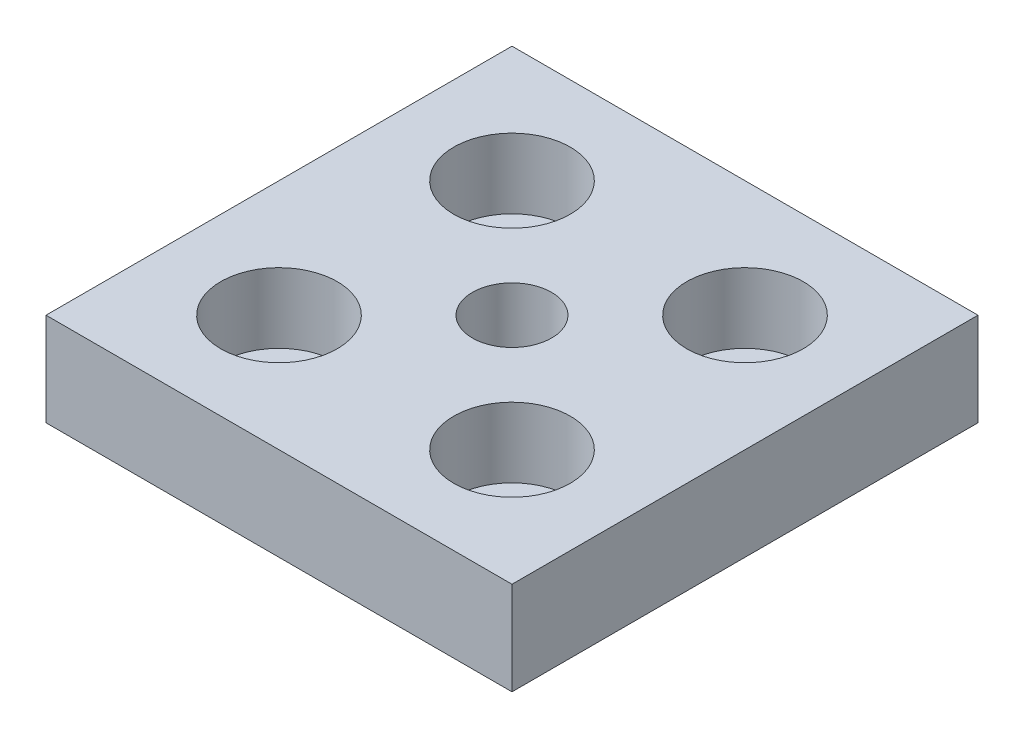
ISO-10303-21;
HEADER;
FILE_DESCRIPTION(('STEP AP214'),'2;1');
FILE_NAME('part.step','',(''),(''),'','','');
FILE_SCHEMA(('AUTOMOTIVE_DESIGN { 1 0 10303 214 1 1 1 1 }'));
ENDSEC;
DATA;
#1=APPLICATION_CONTEXT('core data for automotive mechanical design processes');
#2=APPLICATION_PROTOCOL_DEFINITION('international standard','automotive_design',2000,#1);
#3=PRODUCT_CONTEXT('',#1,'mechanical');
#4=PRODUCT('Part','Part','',(#3));
#5=PRODUCT_RELATED_PRODUCT_CATEGORY('part','',(#4));
#6=PRODUCT_DEFINITION_FORMATION('','',#4);
#7=PRODUCT_DEFINITION_CONTEXT('part definition',#1,'design');
#8=PRODUCT_DEFINITION('design','',#6,#7);
#9=PRODUCT_DEFINITION_SHAPE('','',#8);
#10=(LENGTH_UNIT() NAMED_UNIT(*) SI_UNIT(.MILLI.,.METRE.));
#11=(NAMED_UNIT(*) PLANE_ANGLE_UNIT() SI_UNIT($,.RADIAN.));
#12=(NAMED_UNIT(*) SI_UNIT($,.STERADIAN.) SOLID_ANGLE_UNIT());
#13=UNCERTAINTY_MEASURE_WITH_UNIT(LENGTH_MEASURE(1.E-05),#10,'distance_accuracy_value','');
#14=(GEOMETRIC_REPRESENTATION_CONTEXT(3) GLOBAL_UNCERTAINTY_ASSIGNED_CONTEXT((#13)) GLOBAL_UNIT_ASSIGNED_CONTEXT((#10,
#11,#12)) REPRESENTATION_CONTEXT('',''));
#15=CARTESIAN_POINT('',(0.,0.,0.));
#16=DIRECTION('',(0.,0.,1.));
#17=DIRECTION('',(1.,0.,0.));
#18=AXIS2_PLACEMENT_3D('',#15,#16,#17);
#19=CARTESIAN_POINT('',(-15.,0.,-15.));
#20=DIRECTION('',(0.,1.,0.));
#21=DIRECTION('',(0.,0.,1.));
#22=AXIS2_PLACEMENT_3D('',#19,#20,#21);
#23=CYLINDRICAL_SURFACE('',#22,4.5);
#24=CARTESIAN_POINT('',(-15.,0.,-15.));
#25=DIRECTION('',(0.,1.,0.));
#26=DIRECTION('',(0.,0.,1.));
#27=AXIS2_PLACEMENT_3D('',#24,#25,#26);
#28=CIRCLE('',#27,4.5);
#29=CARTESIAN_POINT('',(-15.,0.,-10.5));
#30=VERTEX_POINT('',#29);
#31=EDGE_CURVE('E137',#30,#30,#28,.T.);
#32=ORIENTED_EDGE('',*,*,#31,.F.);
#33=EDGE_LOOP('',(#32));
#34=FACE_BOUND('',#33,.T.);
#35=CARTESIAN_POINT('',(-15.,3.,-15.));
#36=DIRECTION('',(0.,1.,0.));
#37=DIRECTION('',(0.,0.,1.));
#38=AXIS2_PLACEMENT_3D('',#35,#36,#37);
#39=CIRCLE('',#38,4.5);
#40=CARTESIAN_POINT('',(-15.,3.,-10.5));
#41=VERTEX_POINT('',#40);
#42=EDGE_CURVE('E41',#41,#41,#39,.F.);
#43=ORIENTED_EDGE('',*,*,#42,.F.);
#44=EDGE_LOOP('',(#43));
#45=FACE_BOUND('',#44,.T.);
#46=ADVANCED_FACE('F37',(#34,#45),#23,.F.);
#47=CARTESIAN_POINT('',(15.,0.,-15.));
#48=DIRECTION('',(0.,1.,0.));
#49=DIRECTION('',(0.,0.,1.));
#50=AXIS2_PLACEMENT_3D('',#47,#48,#49);
#51=CYLINDRICAL_SURFACE('',#50,4.5);
#52=CARTESIAN_POINT('',(15.,0.,-15.));
#53=DIRECTION('',(0.,1.,0.));
#54=DIRECTION('',(0.,0.,1.));
#55=AXIS2_PLACEMENT_3D('',#52,#53,#54);
#56=CIRCLE('',#55,4.5);
#57=CARTESIAN_POINT('',(15.,0.,-10.5));
#58=VERTEX_POINT('',#57);
#59=EDGE_CURVE('E133',#58,#58,#56,.T.);
#60=ORIENTED_EDGE('',*,*,#59,.F.);
#61=EDGE_LOOP('',(#60));
#62=FACE_BOUND('',#61,.T.);
#63=CARTESIAN_POINT('',(15.,3.,-15.));
#64=DIRECTION('',(0.,1.,0.));
#65=DIRECTION('',(0.,0.,1.));
#66=AXIS2_PLACEMENT_3D('',#63,#64,#65);
#67=CIRCLE('',#66,4.5);
#68=CARTESIAN_POINT('',(15.,3.,-10.5));
#69=VERTEX_POINT('',#68);
#70=EDGE_CURVE('E119',#69,#69,#67,.F.);
#71=ORIENTED_EDGE('',*,*,#70,.F.);
#72=EDGE_LOOP('',(#71));
#73=FACE_BOUND('',#72,.T.);
#74=ADVANCED_FACE('F165',(#62,#73),#51,.F.);
#75=CARTESIAN_POINT('',(15.,0.,15.));
#76=DIRECTION('',(0.,1.,0.));
#77=DIRECTION('',(0.,0.,1.));
#78=AXIS2_PLACEMENT_3D('',#75,#76,#77);
#79=CYLINDRICAL_SURFACE('',#78,4.5);
#80=CARTESIAN_POINT('',(15.,0.,15.));
#81=DIRECTION('',(0.,1.,0.));
#82=DIRECTION('',(0.,0.,1.));
#83=AXIS2_PLACEMENT_3D('',#80,#81,#82);
#84=CIRCLE('',#83,4.5);
#85=CARTESIAN_POINT('',(15.,0.,19.5));
#86=VERTEX_POINT('',#85);
#87=EDGE_CURVE('E128',#86,#86,#84,.T.);
#88=ORIENTED_EDGE('',*,*,#87,.F.);
#89=EDGE_LOOP('',(#88));
#90=FACE_BOUND('',#89,.T.);
#91=CARTESIAN_POINT('',(15.,3.,15.));
#92=DIRECTION('',(0.,1.,0.));
#93=DIRECTION('',(0.,0.,1.));
#94=AXIS2_PLACEMENT_3D('',#91,#92,#93);
#95=CIRCLE('',#94,4.5);
#96=CARTESIAN_POINT('',(15.,3.,19.5));
#97=VERTEX_POINT('',#96);
#98=EDGE_CURVE('E116',#97,#97,#95,.F.);
#99=ORIENTED_EDGE('',*,*,#98,.F.);
#100=EDGE_LOOP('',(#99));
#101=FACE_BOUND('',#100,.T.);
#102=ADVANCED_FACE('F171',(#90,#101),#79,.F.);
#103=CARTESIAN_POINT('',(-15.,0.,15.));
#104=DIRECTION('',(0.,1.,0.));
#105=DIRECTION('',(0.,0.,1.));
#106=AXIS2_PLACEMENT_3D('',#103,#104,#105);
#107=CYLINDRICAL_SURFACE('',#106,4.5);
#108=CARTESIAN_POINT('',(-15.,0.,15.));
#109=DIRECTION('',(0.,1.,0.));
#110=DIRECTION('',(0.,0.,1.));
#111=AXIS2_PLACEMENT_3D('',#108,#109,#110);
#112=CIRCLE('',#111,4.5);
#113=CARTESIAN_POINT('',(-15.,0.,19.5));
#114=VERTEX_POINT('',#113);
#115=EDGE_CURVE('E124',#114,#114,#112,.T.);
#116=ORIENTED_EDGE('',*,*,#115,.F.);
#117=EDGE_LOOP('',(#116));
#118=FACE_BOUND('',#117,.T.);
#119=CARTESIAN_POINT('',(-15.,3.,15.));
#120=DIRECTION('',(0.,1.,0.));
#121=DIRECTION('',(0.,0.,1.));
#122=AXIS2_PLACEMENT_3D('',#119,#120,#121);
#123=CIRCLE('',#122,4.5);
#124=CARTESIAN_POINT('',(-15.,3.,19.5));
#125=VERTEX_POINT('',#124);
#126=EDGE_CURVE('E113',#125,#125,#123,.F.);
#127=ORIENTED_EDGE('',*,*,#126,.F.);
#128=EDGE_LOOP('',(#127));
#129=FACE_BOUND('',#128,.T.);
#130=ADVANCED_FACE('F178',(#118,#129),#107,.F.);
#131=CARTESIAN_POINT('',(30.,12.,30.));
#132=DIRECTION('',(-1.,0.,0.));
#133=DIRECTION('',(0.,0.,1.));
#134=AXIS2_PLACEMENT_3D('',#131,#132,#133);
#135=PLANE('',#134);
#136=DIRECTION('',(0.,0.,-1.));
#137=VECTOR('',#136,1.);
#138=CARTESIAN_POINT('',(30.,0.,30.));
#139=LINE('',#138,#137);
#140=CARTESIAN_POINT('',(30.,0.,30.));
#141=VERTEX_POINT('',#140);
#142=CARTESIAN_POINT('',(30.,0.,-30.));
#143=VERTEX_POINT('',#142);
#144=EDGE_CURVE('E104',#141,#143,#139,.T.);
#145=ORIENTED_EDGE('',*,*,#144,.T.);
#146=DIRECTION('',(0.,-1.,0.));
#147=VECTOR('',#146,1.);
#148=CARTESIAN_POINT('',(30.,12.,-30.));
#149=LINE('',#148,#147);
#150=CARTESIAN_POINT('',(30.,12.,-30.));
#151=VERTEX_POINT('',#150);
#152=EDGE_CURVE('E11',#151,#143,#149,.T.);
#153=ORIENTED_EDGE('',*,*,#152,.F.);
#154=DIRECTION('',(0.,0.,-1.));
#155=VECTOR('',#154,1.);
#156=CARTESIAN_POINT('',(30.,12.,30.));
#157=LINE('',#156,#155);
#158=CARTESIAN_POINT('',(30.,12.,30.));
#159=VERTEX_POINT('',#158);
#160=EDGE_CURVE('E91',#159,#151,#157,.T.);
#161=ORIENTED_EDGE('',*,*,#160,.F.);
#162=DIRECTION('',(0.,-1.,0.));
#163=VECTOR('',#162,1.);
#164=CARTESIAN_POINT('',(30.,12.,30.));
#165=LINE('',#164,#163);
#166=EDGE_CURVE('E100',#159,#141,#165,.T.);
#167=ORIENTED_EDGE('',*,*,#166,.T.);
#168=EDGE_LOOP('',(#145,#153,#161,#167));
#169=FACE_BOUND('',#168,.T.);
#170=ADVANCED_FACE('F39',(#169),#135,.F.);
#171=CARTESIAN_POINT('',(-30.,12.,-30.));
#172=DIRECTION('',(0.,0.,1.));
#173=DIRECTION('',(1.,0.,0.));
#174=AXIS2_PLACEMENT_3D('',#171,#172,#173);
#175=PLANE('',#174);
#176=DIRECTION('',(-1.,0.,0.));
#177=VECTOR('',#176,1.);
#178=CARTESIAN_POINT('',(-30.,0.,-30.));
#179=LINE('',#178,#177);
#180=CARTESIAN_POINT('',(-30.,0.,-30.));
#181=VERTEX_POINT('',#180);
#182=EDGE_CURVE('E95',#143,#181,#179,.T.);
#183=ORIENTED_EDGE('',*,*,#182,.T.);
#184=DIRECTION('',(0.,-1.,0.));
#185=VECTOR('',#184,1.);
#186=CARTESIAN_POINT('',(-30.,12.,-30.));
#187=LINE('',#186,#185);
#188=CARTESIAN_POINT('',(-30.,12.,-30.));
#189=VERTEX_POINT('',#188);
#190=EDGE_CURVE('E47',#189,#181,#187,.T.);
#191=ORIENTED_EDGE('',*,*,#190,.F.);
#192=DIRECTION('',(-1.,0.,0.));
#193=VECTOR('',#192,1.);
#194=CARTESIAN_POINT('',(-30.,12.,-30.));
#195=LINE('',#194,#193);
#196=EDGE_CURVE('E86',#151,#189,#195,.T.);
#197=ORIENTED_EDGE('',*,*,#196,.F.);
#198=ORIENTED_EDGE('',*,*,#152,.T.);
#199=EDGE_LOOP('',(#183,#191,#197,#198));
#200=FACE_BOUND('',#199,.T.);
#201=ADVANCED_FACE('F94',(#200),#175,.F.);
#202=CARTESIAN_POINT('',(-30.,12.,30.));
#203=DIRECTION('',(1.,0.,0.));
#204=DIRECTION('',(0.,0.,-1.));
#205=AXIS2_PLACEMENT_3D('',#202,#203,#204);
#206=PLANE('',#205);
#207=DIRECTION('',(0.,0.,1.));
#208=VECTOR('',#207,1.);
#209=CARTESIAN_POINT('',(-30.,0.,30.));
#210=LINE('',#209,#208);
#211=CARTESIAN_POINT('',(-30.,0.,30.));
#212=VERTEX_POINT('',#211);
#213=EDGE_CURVE('E73',#181,#212,#210,.T.);
#214=ORIENTED_EDGE('',*,*,#213,.T.);
#215=DIRECTION('',(0.,-1.,0.));
#216=VECTOR('',#215,1.);
#217=CARTESIAN_POINT('',(-30.,12.,30.));
#218=LINE('',#217,#216);
#219=CARTESIAN_POINT('',(-30.,12.,30.));
#220=VERTEX_POINT('',#219);
#221=EDGE_CURVE('E96',#220,#212,#218,.T.);
#222=ORIENTED_EDGE('',*,*,#221,.F.);
#223=DIRECTION('',(0.,0.,1.));
#224=VECTOR('',#223,1.);
#225=CARTESIAN_POINT('',(-30.,12.,30.));
#226=LINE('',#225,#224);
#227=EDGE_CURVE('E89',#189,#220,#226,.T.);
#228=ORIENTED_EDGE('',*,*,#227,.F.);
#229=ORIENTED_EDGE('',*,*,#190,.T.);
#230=EDGE_LOOP('',(#214,#222,#228,#229));
#231=FACE_BOUND('',#230,.T.);
#232=ADVANCED_FACE('F98',(#231),#206,.F.);
#233=CARTESIAN_POINT('',(-30.,12.,30.));
#234=DIRECTION('',(0.,0.,-1.));
#235=DIRECTION('',(-1.,0.,0.));
#236=AXIS2_PLACEMENT_3D('',#233,#234,#235);
#237=PLANE('',#236);
#238=DIRECTION('',(1.,0.,0.));
#239=VECTOR('',#238,1.);
#240=CARTESIAN_POINT('',(-30.,0.,30.));
#241=LINE('',#240,#239);
#242=EDGE_CURVE('E79',#212,#141,#241,.T.);
#243=ORIENTED_EDGE('',*,*,#242,.T.);
#244=ORIENTED_EDGE('',*,*,#166,.F.);
#245=DIRECTION('',(1.,0.,0.));
#246=VECTOR('',#245,1.);
#247=CARTESIAN_POINT('',(-30.,12.,30.));
#248=LINE('',#247,#246);
#249=EDGE_CURVE('E56',#220,#159,#248,.T.);
#250=ORIENTED_EDGE('',*,*,#249,.F.);
#251=ORIENTED_EDGE('',*,*,#221,.T.);
#252=EDGE_LOOP('',(#243,#244,#250,#251));
#253=FACE_BOUND('',#252,.T.);
#254=ADVANCED_FACE('F154',(#253),#237,.F.);
#255=CARTESIAN_POINT('',(0.,12.,0.));
#256=DIRECTION('',(0.,-1.,0.));
#257=DIRECTION('',(0.,0.,-1.));
#258=AXIS2_PLACEMENT_3D('',#255,#256,#257);
#259=PLANE('',#258);
#260=CARTESIAN_POINT('',(-15.,12.,15.));
#261=DIRECTION('',(0.,1.,0.));
#262=DIRECTION('',(0.,0.,1.));
#263=AXIS2_PLACEMENT_3D('',#260,#261,#262);
#264=CIRCLE('',#263,7.5);
#265=CARTESIAN_POINT('',(-15.,12.,22.5));
#266=VERTEX_POINT('',#265);
#267=EDGE_CURVE('E255',#266,#266,#264,.T.);
#268=ORIENTED_EDGE('',*,*,#267,.F.);
#269=EDGE_LOOP('',(#268));
#270=FACE_BOUND('',#269,.T.);
#271=CARTESIAN_POINT('',(15.,12.,15.));
#272=DIRECTION('',(0.,1.,0.));
#273=DIRECTION('',(0.,0.,1.));
#274=AXIS2_PLACEMENT_3D('',#271,#272,#273);
#275=CIRCLE('',#274,7.5);
#276=CARTESIAN_POINT('',(15.,12.,22.5));
#277=VERTEX_POINT('',#276);
#278=EDGE_CURVE('E250',#277,#277,#275,.T.);
#279=ORIENTED_EDGE('',*,*,#278,.F.);
#280=EDGE_LOOP('',(#279));
#281=FACE_BOUND('',#280,.T.);
#282=CARTESIAN_POINT('',(15.,12.,-15.));
#283=DIRECTION('',(0.,1.,0.));
#284=DIRECTION('',(0.,0.,1.));
#285=AXIS2_PLACEMENT_3D('',#282,#283,#284);
#286=CIRCLE('',#285,7.5);
#287=CARTESIAN_POINT('',(15.,12.,-7.5));
#288=VERTEX_POINT('',#287);
#289=EDGE_CURVE('E241',#288,#288,#286,.T.);
#290=ORIENTED_EDGE('',*,*,#289,.F.);
#291=EDGE_LOOP('',(#290));
#292=FACE_BOUND('',#291,.T.);
#293=CARTESIAN_POINT('',(-15.,12.,-15.));
#294=DIRECTION('',(0.,1.,0.));
#295=DIRECTION('',(0.,0.,1.));
#296=AXIS2_PLACEMENT_3D('',#293,#294,#295);
#297=CIRCLE('',#296,7.5);
#298=CARTESIAN_POINT('',(-15.,12.,-7.5));
#299=VERTEX_POINT('',#298);
#300=EDGE_CURVE('E240',#299,#299,#297,.T.);
#301=ORIENTED_EDGE('',*,*,#300,.F.);
#302=EDGE_LOOP('',(#301));
#303=FACE_BOUND('',#302,.T.);
#304=CARTESIAN_POINT('',(0.,12.,0.));
#305=DIRECTION('',(0.,1.,0.));
#306=DIRECTION('',(0.,0.,1.));
#307=AXIS2_PLACEMENT_3D('',#304,#305,#306);
#308=CIRCLE('',#307,5.1);
#309=CARTESIAN_POINT('',(0.,12.,5.1));
#310=VERTEX_POINT('',#309);
#311=EDGE_CURVE('E140',#310,#310,#308,.T.);
#312=ORIENTED_EDGE('',*,*,#311,.F.);
#313=EDGE_LOOP('',(#312));
#314=FACE_BOUND('',#313,.T.);
#315=ORIENTED_EDGE('',*,*,#160,.T.);
#316=ORIENTED_EDGE('',*,*,#196,.T.);
#317=ORIENTED_EDGE('',*,*,#227,.T.);
#318=ORIENTED_EDGE('',*,*,#249,.T.);
#319=EDGE_LOOP('',(#315,#316,#317,#318));
#320=FACE_BOUND('',#319,.T.);
#321=ADVANCED_FACE('F87',(#270,#281,#292,#303,#314,#320),#259,.F.);
#322=CARTESIAN_POINT('',(0.,0.,0.));
#323=DIRECTION('',(0.,-1.,0.));
#324=DIRECTION('',(0.,0.,-1.));
#325=AXIS2_PLACEMENT_3D('',#322,#323,#324);
#326=PLANE('',#325);
#327=ORIENTED_EDGE('',*,*,#115,.T.);
#328=EDGE_LOOP('',(#327));
#329=FACE_BOUND('',#328,.T.);
#330=ORIENTED_EDGE('',*,*,#87,.T.);
#331=EDGE_LOOP('',(#330));
#332=FACE_BOUND('',#331,.T.);
#333=ORIENTED_EDGE('',*,*,#59,.T.);
#334=EDGE_LOOP('',(#333));
#335=FACE_BOUND('',#334,.T.);
#336=ORIENTED_EDGE('',*,*,#31,.T.);
#337=EDGE_LOOP('',(#336));
#338=FACE_BOUND('',#337,.T.);
#339=CARTESIAN_POINT('',(0.,0.,0.));
#340=DIRECTION('',(0.,-1.,0.));
#341=DIRECTION('',(0.,0.,-1.));
#342=AXIS2_PLACEMENT_3D('',#339,#340,#341);
#343=CIRCLE('',#342,5.1);
#344=CARTESIAN_POINT('',(0.,0.,-5.1));
#345=VERTEX_POINT('',#344);
#346=EDGE_CURVE('E107',#345,#345,#343,.T.);
#347=ORIENTED_EDGE('',*,*,#346,.F.);
#348=EDGE_LOOP('',(#347));
#349=FACE_BOUND('',#348,.T.);
#350=ORIENTED_EDGE('',*,*,#144,.F.);
#351=ORIENTED_EDGE('',*,*,#242,.F.);
#352=ORIENTED_EDGE('',*,*,#213,.F.);
#353=ORIENTED_EDGE('',*,*,#182,.F.);
#354=EDGE_LOOP('',(#350,#351,#352,#353));
#355=FACE_BOUND('',#354,.T.);
#356=ADVANCED_FACE('F148',(#329,#332,#335,#338,#349,#355),#326,.T.);
#357=CARTESIAN_POINT('',(0.,12.,0.));
#358=DIRECTION('',(0.,1.,0.));
#359=DIRECTION('',(0.,0.,1.));
#360=AXIS2_PLACEMENT_3D('',#357,#358,#359);
#361=CYLINDRICAL_SURFACE('',#360,5.1);
#362=ORIENTED_EDGE('',*,*,#311,.T.);
#363=EDGE_LOOP('',(#362));
#364=FACE_BOUND('',#363,.T.);
#365=ORIENTED_EDGE('',*,*,#346,.T.);
#366=EDGE_LOOP('',(#365));
#367=FACE_BOUND('',#366,.T.);
#368=ADVANCED_FACE('F146',(#364,#367),#361,.F.);
#369=CARTESIAN_POINT('',(-15.,3.,15.));
#370=DIRECTION('',(0.,1.,0.));
#371=DIRECTION('',(0.,0.,1.));
#372=AXIS2_PLACEMENT_3D('',#369,#370,#371);
#373=PLANE('',#372);
#374=CARTESIAN_POINT('',(-15.,3.,15.));
#375=DIRECTION('',(0.,1.,0.));
#376=DIRECTION('',(0.,0.,1.));
#377=AXIS2_PLACEMENT_3D('',#374,#375,#376);
#378=CIRCLE('',#377,7.5);
#379=CARTESIAN_POINT('',(-15.,3.,22.5));
#380=VERTEX_POINT('',#379);
#381=EDGE_CURVE('E253',#380,#380,#378,.T.);
#382=ORIENTED_EDGE('',*,*,#381,.T.);
#383=EDGE_LOOP('',(#382));
#384=FACE_BOUND('',#383,.T.);
#385=ORIENTED_EDGE('',*,*,#126,.T.);
#386=EDGE_LOOP('',(#385));
#387=FACE_BOUND('',#386,.T.);
#388=ADVANCED_FACE('F181',(#384,#387),#373,.T.);
#389=CARTESIAN_POINT('',(-15.,3.,15.));
#390=DIRECTION('',(0.,1.,0.));
#391=DIRECTION('',(0.,0.,1.));
#392=AXIS2_PLACEMENT_3D('',#389,#390,#391);
#393=CYLINDRICAL_SURFACE('',#392,7.5);
#394=ORIENTED_EDGE('',*,*,#381,.F.);
#395=EDGE_LOOP('',(#394));
#396=FACE_BOUND('',#395,.T.);
#397=ORIENTED_EDGE('',*,*,#267,.T.);
#398=EDGE_LOOP('',(#397));
#399=FACE_BOUND('',#398,.T.);
#400=ADVANCED_FACE('F186',(#396,#399),#393,.F.);
#401=CARTESIAN_POINT('',(15.,3.,15.));
#402=DIRECTION('',(0.,1.,0.));
#403=DIRECTION('',(0.,0.,1.));
#404=AXIS2_PLACEMENT_3D('',#401,#402,#403);
#405=PLANE('',#404);
#406=CARTESIAN_POINT('',(15.,3.,15.));
#407=DIRECTION('',(0.,1.,0.));
#408=DIRECTION('',(0.,0.,1.));
#409=AXIS2_PLACEMENT_3D('',#406,#407,#408);
#410=CIRCLE('',#409,7.5);
#411=CARTESIAN_POINT('',(15.,3.,22.5));
#412=VERTEX_POINT('',#411);
#413=EDGE_CURVE('E246',#412,#412,#410,.T.);
#414=ORIENTED_EDGE('',*,*,#413,.T.);
#415=EDGE_LOOP('',(#414));
#416=FACE_BOUND('',#415,.T.);
#417=ORIENTED_EDGE('',*,*,#98,.T.);
#418=EDGE_LOOP('',(#417));
#419=FACE_BOUND('',#418,.T.);
#420=ADVANCED_FACE('F194',(#416,#419),#405,.T.);
#421=CARTESIAN_POINT('',(15.,3.,15.));
#422=DIRECTION('',(0.,1.,0.));
#423=DIRECTION('',(0.,0.,1.));
#424=AXIS2_PLACEMENT_3D('',#421,#422,#423);
#425=CYLINDRICAL_SURFACE('',#424,7.5);
#426=ORIENTED_EDGE('',*,*,#413,.F.);
#427=EDGE_LOOP('',(#426));
#428=FACE_BOUND('',#427,.T.);
#429=ORIENTED_EDGE('',*,*,#278,.T.);
#430=EDGE_LOOP('',(#429));
#431=FACE_BOUND('',#430,.T.);
#432=ADVANCED_FACE('F200',(#428,#431),#425,.F.);
#433=CARTESIAN_POINT('',(15.,3.,-15.));
#434=DIRECTION('',(0.,1.,0.));
#435=DIRECTION('',(0.,0.,1.));
#436=AXIS2_PLACEMENT_3D('',#433,#434,#435);
#437=PLANE('',#436);
#438=CARTESIAN_POINT('',(15.,3.,-15.));
#439=DIRECTION('',(0.,1.,0.));
#440=DIRECTION('',(0.,0.,1.));
#441=AXIS2_PLACEMENT_3D('',#438,#439,#440);
#442=CIRCLE('',#441,7.5);
#443=CARTESIAN_POINT('',(15.,3.,-7.5));
#444=VERTEX_POINT('',#443);
#445=EDGE_CURVE('E239',#444,#444,#442,.T.);
#446=ORIENTED_EDGE('',*,*,#445,.T.);
#447=EDGE_LOOP('',(#446));
#448=FACE_BOUND('',#447,.T.);
#449=ORIENTED_EDGE('',*,*,#70,.T.);
#450=EDGE_LOOP('',(#449));
#451=FACE_BOUND('',#450,.T.);
#452=ADVANCED_FACE('F226',(#448,#451),#437,.T.);
#453=CARTESIAN_POINT('',(15.,3.,-15.));
#454=DIRECTION('',(0.,1.,0.));
#455=DIRECTION('',(0.,0.,1.));
#456=AXIS2_PLACEMENT_3D('',#453,#454,#455);
#457=CYLINDRICAL_SURFACE('',#456,7.5);
#458=ORIENTED_EDGE('',*,*,#445,.F.);
#459=EDGE_LOOP('',(#458));
#460=FACE_BOUND('',#459,.T.);
#461=ORIENTED_EDGE('',*,*,#289,.T.);
#462=EDGE_LOOP('',(#461));
#463=FACE_BOUND('',#462,.T.);
#464=ADVANCED_FACE('F207',(#460,#463),#457,.F.);
#465=CARTESIAN_POINT('',(-15.,3.,-15.));
#466=DIRECTION('',(0.,1.,0.));
#467=DIRECTION('',(0.,0.,1.));
#468=AXIS2_PLACEMENT_3D('',#465,#466,#467);
#469=PLANE('',#468);
#470=CARTESIAN_POINT('',(-15.,3.,-15.));
#471=DIRECTION('',(0.,1.,0.));
#472=DIRECTION('',(0.,0.,1.));
#473=AXIS2_PLACEMENT_3D('',#470,#471,#472);
#474=CIRCLE('',#473,7.5);
#475=CARTESIAN_POINT('',(-15.,3.,-7.5));
#476=VERTEX_POINT('',#475);
#477=EDGE_CURVE('E117',#476,#476,#474,.T.);
#478=ORIENTED_EDGE('',*,*,#477,.T.);
#479=EDGE_LOOP('',(#478));
#480=FACE_BOUND('',#479,.T.);
#481=ORIENTED_EDGE('',*,*,#42,.T.);
#482=EDGE_LOOP('',(#481));
#483=FACE_BOUND('',#482,.T.);
#484=ADVANCED_FACE('F203',(#480,#483),#469,.T.);
#485=CARTESIAN_POINT('',(-15.,3.,-15.));
#486=DIRECTION('',(0.,1.,0.));
#487=DIRECTION('',(0.,0.,1.));
#488=AXIS2_PLACEMENT_3D('',#485,#486,#487);
#489=CYLINDRICAL_SURFACE('',#488,7.5);
#490=ORIENTED_EDGE('',*,*,#477,.F.);
#491=EDGE_LOOP('',(#490));
#492=FACE_BOUND('',#491,.T.);
#493=ORIENTED_EDGE('',*,*,#300,.T.);
#494=EDGE_LOOP('',(#493));
#495=FACE_BOUND('',#494,.T.);
#496=ADVANCED_FACE('F206',(#492,#495),#489,.F.);
#497=CLOSED_SHELL('',(#46,#74,#102,#130,#170,#201,#232,#254,#321,#356,#368,#388,#400,#420,#432,
#452,#464,#484,#496));
#498=MANIFOLD_SOLID_BREP('B2',#497);
#499=ADVANCED_BREP_SHAPE_REPRESENTATION('',(#18,#498),#14);
#500=SHAPE_DEFINITION_REPRESENTATION(#9,#499);
ENDSEC;
END-ISO-10303-21;
